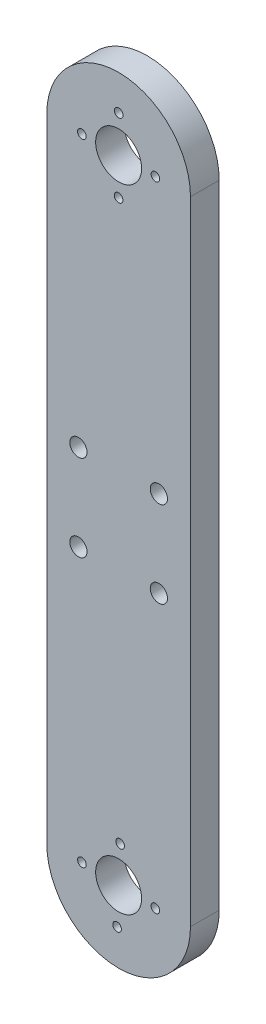
ISO-10303-21;
HEADER;
FILE_DESCRIPTION(('STEP AP214'),'2;1');
FILE_NAME('part.step','',(''),(''),'','','');
FILE_SCHEMA(('AUTOMOTIVE_DESIGN { 1 0 10303 214 1 1 1 1 }'));
ENDSEC;
DATA;
#1=APPLICATION_CONTEXT('core data for automotive mechanical design processes');
#2=APPLICATION_PROTOCOL_DEFINITION('international standard','automotive_design',2000,#1);
#3=PRODUCT_CONTEXT('',#1,'mechanical');
#4=PRODUCT('Part','Part','',(#3));
#5=PRODUCT_RELATED_PRODUCT_CATEGORY('part','',(#4));
#6=PRODUCT_DEFINITION_FORMATION('','',#4);
#7=PRODUCT_DEFINITION_CONTEXT('part definition',#1,'design');
#8=PRODUCT_DEFINITION('design','',#6,#7);
#9=PRODUCT_DEFINITION_SHAPE('','',#8);
#10=(LENGTH_UNIT() NAMED_UNIT(*) SI_UNIT(.MILLI.,.METRE.));
#11=(NAMED_UNIT(*) PLANE_ANGLE_UNIT() SI_UNIT($,.RADIAN.));
#12=(NAMED_UNIT(*) SI_UNIT($,.STERADIAN.) SOLID_ANGLE_UNIT());
#13=UNCERTAINTY_MEASURE_WITH_UNIT(LENGTH_MEASURE(1.E-05),#10,'distance_accuracy_value','');
#14=(GEOMETRIC_REPRESENTATION_CONTEXT(3) GLOBAL_UNCERTAINTY_ASSIGNED_CONTEXT((#13)) GLOBAL_UNIT_ASSIGNED_CONTEXT((#10,
#11,#12)) REPRESENTATION_CONTEXT('',''));
#15=CARTESIAN_POINT('',(0.,0.,0.));
#16=DIRECTION('',(0.,0.,1.));
#17=DIRECTION('',(1.,0.,0.));
#18=AXIS2_PLACEMENT_3D('',#15,#16,#17);
#19=CARTESIAN_POINT('',(0.,0.,5.));
#20=DIRECTION('',(0.,0.,1.));
#21=DIRECTION('',(1.,0.,0.));
#22=AXIS2_PLACEMENT_3D('',#19,#20,#21);
#23=PLANE('',#22);
#24=CARTESIAN_POINT('',(-6.39095011321381,-109.733832455118,5.));
#25=DIRECTION('',(0.,0.,1.));
#26=DIRECTION('',(1.,0.,0.));
#27=AXIS2_PLACEMENT_3D('',#24,#25,#26);
#28=CIRCLE('',#27,0.749999999990413);
#29=CARTESIAN_POINT('',(-5.6409501132234,-109.733832455118,5.));
#30=VERTEX_POINT('',#29);
#31=EDGE_CURVE('E181',#30,#30,#28,.T.);
#32=ORIENTED_EDGE('',*,*,#31,.F.);
#33=EDGE_LOOP('',(#32));
#34=FACE_BOUND('',#33,.T.);
#35=CARTESIAN_POINT('',(6.3964839650597,-0.00902201551031961,5.));
#36=DIRECTION('',(0.,0.,1.));
#37=DIRECTION('',(1.,0.,0.));
#38=AXIS2_PLACEMENT_3D('',#35,#36,#37);
#39=CIRCLE('',#38,0.750000000010934);
#40=CARTESIAN_POINT('',(7.14648396507063,-0.00902201551031961,5.));
#41=VERTEX_POINT('',#40);
#42=EDGE_CURVE('E169',#41,#41,#39,.T.);
#43=ORIENTED_EDGE('',*,*,#42,.F.);
#44=EDGE_LOOP('',(#43));
#45=FACE_BOUND('',#44,.T.);
#46=CARTESIAN_POINT('',(0.00902201505638306,6.39648396453316,5.));
#47=DIRECTION('',(0.,0.,1.));
#48=DIRECTION('',(1.,0.,0.));
#49=AXIS2_PLACEMENT_3D('',#46,#47,#48);
#50=CIRCLE('',#49,0.749999999996068);
#51=CARTESIAN_POINT('',(0.759022015052451,6.39648396453316,5.));
#52=VERTEX_POINT('',#51);
#53=EDGE_CURVE('E157',#52,#52,#50,.T.);
#54=ORIENTED_EDGE('',*,*,#53,.F.);
#55=EDGE_LOOP('',(#54));
#56=FACE_BOUND('',#55,.T.);
#57=CARTESIAN_POINT('',(-6.99999999999999,-62.5,5.));
#58=DIRECTION('',(0.,0.,1.));
#59=DIRECTION('',(-1.,0.,0.));
#60=AXIS2_PLACEMENT_3D('',#57,#58,#59);
#61=CIRCLE('',#60,1.5);
#62=CARTESIAN_POINT('',(-8.49999999999999,-62.5,5.));
#63=VERTEX_POINT('',#62);
#64=EDGE_CURVE('E145',#63,#63,#61,.T.);
#65=ORIENTED_EDGE('',*,*,#64,.F.);
#66=EDGE_LOOP('',(#65));
#67=FACE_BOUND('',#66,.T.);
#68=CARTESIAN_POINT('',(-6.39648396498707,0.00902201452982268,5.));
#69=DIRECTION('',(0.,0.,1.));
#70=DIRECTION('',(1.,0.,0.));
#71=AXIS2_PLACEMENT_3D('',#68,#69,#70);
#72=CIRCLE('',#71,0.749999999989094);
#73=CARTESIAN_POINT('',(-5.64648396499798,0.00902201452982268,5.));
#74=VERTEX_POINT('',#73);
#75=EDGE_CURVE('E133',#74,#74,#72,.T.);
#76=ORIENTED_EDGE('',*,*,#75,.F.);
#77=EDGE_LOOP('',(#76));
#78=FACE_BOUND('',#77,.T.);
#79=CARTESIAN_POINT('',(7.00000000000001,-47.5,5.));
#80=DIRECTION('',(0.,0.,1.));
#81=DIRECTION('',(1.,0.,0.));
#82=AXIS2_PLACEMENT_3D('',#79,#80,#81);
#83=CIRCLE('',#82,1.5);
#84=CARTESIAN_POINT('',(8.50000000000001,-47.5,5.));
#85=VERTEX_POINT('',#84);
#86=EDGE_CURVE('E121',#85,#85,#83,.T.);
#87=ORIENTED_EDGE('',*,*,#86,.F.);
#88=EDGE_LOOP('',(#87));
#89=FACE_BOUND('',#88,.T.);
#90=CARTESIAN_POINT('',(0.,0.,5.));
#91=DIRECTION('',(0.,0.,1.));
#92=DIRECTION('',(1.,0.,0.));
#93=AXIS2_PLACEMENT_3D('',#90,#91,#92);
#94=CIRCLE('',#93,4.);
#95=CARTESIAN_POINT('',(4.,0.,5.));
#96=VERTEX_POINT('',#95);
#97=EDGE_CURVE('E100',#96,#96,#94,.T.);
#98=ORIENTED_EDGE('',*,*,#97,.F.);
#99=EDGE_LOOP('',(#98));
#100=FACE_BOUND('',#99,.T.);
#101=CARTESIAN_POINT('',(0.,0.,5.));
#102=DIRECTION('',(0.,0.,1.));
#103=DIRECTION('',(1.,0.,0.));
#104=AXIS2_PLACEMENT_3D('',#101,#102,#103);
#105=CIRCLE('',#104,12.5);
#106=CARTESIAN_POINT('',(12.5,0.,5.));
#107=VERTEX_POINT('',#106);
#108=CARTESIAN_POINT('',(-12.5,0.,5.));
#109=VERTEX_POINT('',#108);
#110=EDGE_CURVE('E85',#107,#109,#105,.T.);
#111=ORIENTED_EDGE('',*,*,#110,.T.);
#112=DIRECTION('',(0.,-1.,0.));
#113=VECTOR('',#112,1.);
#114=CARTESIAN_POINT('',(-12.5,0.,5.));
#115=LINE('',#114,#113);
#116=CARTESIAN_POINT('',(-12.5,-110.,5.));
#117=VERTEX_POINT('',#116);
#118=EDGE_CURVE('E80',#109,#117,#115,.T.);
#119=ORIENTED_EDGE('',*,*,#118,.T.);
#120=CARTESIAN_POINT('',(0.,-110.,5.));
#121=DIRECTION('',(0.,0.,1.));
#122=DIRECTION('',(1.,0.,0.));
#123=AXIS2_PLACEMENT_3D('',#120,#121,#122);
#124=CIRCLE('',#123,12.5);
#125=CARTESIAN_POINT('',(12.5,-110.,5.));
#126=VERTEX_POINT('',#125);
#127=EDGE_CURVE('E83',#117,#126,#124,.T.);
#128=ORIENTED_EDGE('',*,*,#127,.T.);
#129=DIRECTION('',(0.,1.,0.));
#130=VECTOR('',#129,1.);
#131=CARTESIAN_POINT('',(12.5,0.,5.));
#132=LINE('',#131,#130);
#133=EDGE_CURVE('E50',#126,#107,#132,.T.);
#134=ORIENTED_EDGE('',*,*,#133,.T.);
#135=EDGE_LOOP('',(#111,#119,#128,#134));
#136=FACE_BOUND('',#135,.T.);
#137=CARTESIAN_POINT('',(0.,-110.,5.));
#138=DIRECTION('',(0.,0.,1.));
#139=DIRECTION('',(1.,0.,0.));
#140=AXIS2_PLACEMENT_3D('',#137,#138,#139);
#141=CIRCLE('',#140,4.);
#142=CARTESIAN_POINT('',(4.00000000000001,-110.,5.));
#143=VERTEX_POINT('',#142);
#144=EDGE_CURVE('E115',#143,#143,#141,.T.);
#145=ORIENTED_EDGE('',*,*,#144,.F.);
#146=EDGE_LOOP('',(#145));
#147=FACE_BOUND('',#146,.T.);
#148=CARTESIAN_POINT('',(-6.99999999999999,-47.5,5.));
#149=DIRECTION('',(0.,0.,1.));
#150=DIRECTION('',(1.,0.,0.));
#151=AXIS2_PLACEMENT_3D('',#148,#149,#150);
#152=CIRCLE('',#151,1.5);
#153=CARTESIAN_POINT('',(-5.49999999999999,-47.5,5.));
#154=VERTEX_POINT('',#153);
#155=EDGE_CURVE('E127',#154,#154,#152,.T.);
#156=ORIENTED_EDGE('',*,*,#155,.F.);
#157=EDGE_LOOP('',(#156));
#158=FACE_BOUND('',#157,.T.);
#159=CARTESIAN_POINT('',(7.00000000000001,-62.5,5.));
#160=DIRECTION('',(0.,0.,1.));
#161=DIRECTION('',(-1.,0.,0.));
#162=AXIS2_PLACEMENT_3D('',#159,#160,#161);
#163=CIRCLE('',#162,1.5);
#164=CARTESIAN_POINT('',(5.50000000000001,-62.5,5.));
#165=VERTEX_POINT('',#164);
#166=EDGE_CURVE('E139',#165,#165,#163,.T.);
#167=ORIENTED_EDGE('',*,*,#166,.F.);
#168=EDGE_LOOP('',(#167));
#169=FACE_BOUND('',#168,.T.);
#170=CARTESIAN_POINT('',(6.39095011321716,-110.266167544877,5.));
#171=DIRECTION('',(0.,0.,1.));
#172=DIRECTION('',(1.,0.,0.));
#173=AXIS2_PLACEMENT_3D('',#170,#171,#172);
#174=CIRCLE('',#173,0.750000000009543);
#175=CARTESIAN_POINT('',(7.1409501132267,-110.266167544877,5.));
#176=VERTEX_POINT('',#175);
#177=EDGE_CURVE('E151',#176,#176,#174,.T.);
#178=ORIENTED_EDGE('',*,*,#177,.F.);
#179=EDGE_LOOP('',(#178));
#180=FACE_BOUND('',#179,.T.);
#181=CARTESIAN_POINT('',(-0.00902201498380599,-6.39648396551361,5.));
#182=DIRECTION('',(0.,0.,1.));
#183=DIRECTION('',(1.,0.,0.));
#184=AXIS2_PLACEMENT_3D('',#181,#182,#183);
#185=CIRCLE('',#184,0.750000000003959);
#186=CARTESIAN_POINT('',(0.740977985020153,-6.39648396551361,5.));
#187=VERTEX_POINT('',#186);
#188=EDGE_CURVE('E163',#187,#187,#185,.T.);
#189=ORIENTED_EDGE('',*,*,#188,.F.);
#190=EDGE_LOOP('',(#189));
#191=FACE_BOUND('',#190,.T.);
#192=CARTESIAN_POINT('',(-0.26616754487793,-116.390950113213,5.));
#193=DIRECTION('',(0.,0.,1.));
#194=DIRECTION('',(1.,0.,0.));
#195=AXIS2_PLACEMENT_3D('',#192,#193,#194);
#196=CIRCLE('',#195,0.749999999993405);
#197=CARTESIAN_POINT('',(0.483832455115476,-116.390950113213,5.));
#198=VERTEX_POINT('',#197);
#199=EDGE_CURVE('E175',#198,#198,#196,.T.);
#200=ORIENTED_EDGE('',*,*,#199,.F.);
#201=EDGE_LOOP('',(#200));
#202=FACE_BOUND('',#201,.T.);
#203=CARTESIAN_POINT('',(0.266167544881222,-103.609049886782,5.));
#204=DIRECTION('',(0.,0.,1.));
#205=DIRECTION('',(1.,0.,0.));
#206=AXIS2_PLACEMENT_3D('',#203,#204,#205);
#207=CIRCLE('',#206,0.750000000006553);
#208=CARTESIAN_POINT('',(1.01616754488778,-103.609049886782,5.));
#209=VERTEX_POINT('',#208);
#210=EDGE_CURVE('E187',#209,#209,#207,.T.);
#211=ORIENTED_EDGE('',*,*,#210,.F.);
#212=EDGE_LOOP('',(#211));
#213=FACE_BOUND('',#212,.T.);
#214=ADVANCED_FACE('F33',(#34,#45,#56,#67,#78,#89,#100,#136,#147,#158,#169,#180,#191,#202,#213),
#23,.T.);
#215=CARTESIAN_POINT('',(0.,0.,0.));
#216=DIRECTION('',(0.,0.,1.));
#217=DIRECTION('',(1.,0.,0.));
#218=AXIS2_PLACEMENT_3D('',#215,#216,#217);
#219=PLANE('',#218);
#220=CARTESIAN_POINT('',(0.,0.,0.));
#221=DIRECTION('',(0.,0.,1.));
#222=DIRECTION('',(1.,0.,0.));
#223=AXIS2_PLACEMENT_3D('',#220,#221,#222);
#224=CIRCLE('',#223,12.5);
#225=CARTESIAN_POINT('',(12.5,0.,0.));
#226=VERTEX_POINT('',#225);
#227=CARTESIAN_POINT('',(-12.5,0.,0.));
#228=VERTEX_POINT('',#227);
#229=EDGE_CURVE('E97',#226,#228,#224,.T.);
#230=ORIENTED_EDGE('',*,*,#229,.F.);
#231=DIRECTION('',(0.,1.,0.));
#232=VECTOR('',#231,1.);
#233=CARTESIAN_POINT('',(12.5,0.,0.));
#234=LINE('',#233,#232);
#235=CARTESIAN_POINT('',(12.5,-110.,0.));
#236=VERTEX_POINT('',#235);
#237=EDGE_CURVE('E73',#236,#226,#234,.T.);
#238=ORIENTED_EDGE('',*,*,#237,.F.);
#239=CARTESIAN_POINT('',(0.,-110.,0.));
#240=DIRECTION('',(0.,0.,1.));
#241=DIRECTION('',(1.,0.,0.));
#242=AXIS2_PLACEMENT_3D('',#239,#240,#241);
#243=CIRCLE('',#242,12.5);
#244=CARTESIAN_POINT('',(-12.5,-110.,0.));
#245=VERTEX_POINT('',#244);
#246=EDGE_CURVE('E67',#245,#236,#243,.T.);
#247=ORIENTED_EDGE('',*,*,#246,.F.);
#248=DIRECTION('',(0.,-1.,0.));
#249=VECTOR('',#248,1.);
#250=CARTESIAN_POINT('',(-12.5,0.,0.));
#251=LINE('',#250,#249);
#252=EDGE_CURVE('E89',#228,#245,#251,.T.);
#253=ORIENTED_EDGE('',*,*,#252,.F.);
#254=EDGE_LOOP('',(#230,#238,#247,#253));
#255=FACE_BOUND('',#254,.T.);
#256=CARTESIAN_POINT('',(0.,0.,0.));
#257=DIRECTION('',(0.,0.,1.));
#258=DIRECTION('',(1.,0.,0.));
#259=AXIS2_PLACEMENT_3D('',#256,#257,#258);
#260=CIRCLE('',#259,4.);
#261=CARTESIAN_POINT('',(4.,0.,0.));
#262=VERTEX_POINT('',#261);
#263=EDGE_CURVE('E112',#262,#262,#260,.T.);
#264=ORIENTED_EDGE('',*,*,#263,.T.);
#265=EDGE_LOOP('',(#264));
#266=FACE_BOUND('',#265,.T.);
#267=CARTESIAN_POINT('',(0.,-110.,0.));
#268=DIRECTION('',(0.,0.,1.));
#269=DIRECTION('',(1.,0.,0.));
#270=AXIS2_PLACEMENT_3D('',#267,#268,#269);
#271=CIRCLE('',#270,4.);
#272=CARTESIAN_POINT('',(4.00000000000001,-110.,0.));
#273=VERTEX_POINT('',#272);
#274=EDGE_CURVE('E118',#273,#273,#271,.T.);
#275=ORIENTED_EDGE('',*,*,#274,.T.);
#276=EDGE_LOOP('',(#275));
#277=FACE_BOUND('',#276,.T.);
#278=CARTESIAN_POINT('',(7.00000000000001,-47.5,0.));
#279=DIRECTION('',(0.,0.,1.));
#280=DIRECTION('',(1.,0.,0.));
#281=AXIS2_PLACEMENT_3D('',#278,#279,#280);
#282=CIRCLE('',#281,1.5);
#283=CARTESIAN_POINT('',(8.50000000000001,-47.5,0.));
#284=VERTEX_POINT('',#283);
#285=EDGE_CURVE('E124',#284,#284,#282,.T.);
#286=ORIENTED_EDGE('',*,*,#285,.T.);
#287=EDGE_LOOP('',(#286));
#288=FACE_BOUND('',#287,.T.);
#289=CARTESIAN_POINT('',(-6.99999999999999,-47.5,0.));
#290=DIRECTION('',(0.,0.,1.));
#291=DIRECTION('',(1.,0.,0.));
#292=AXIS2_PLACEMENT_3D('',#289,#290,#291);
#293=CIRCLE('',#292,1.5);
#294=CARTESIAN_POINT('',(-5.49999999999999,-47.5,0.));
#295=VERTEX_POINT('',#294);
#296=EDGE_CURVE('E130',#295,#295,#293,.T.);
#297=ORIENTED_EDGE('',*,*,#296,.T.);
#298=EDGE_LOOP('',(#297));
#299=FACE_BOUND('',#298,.T.);
#300=CARTESIAN_POINT('',(-6.39648396498707,0.00902201452982268,0.));
#301=DIRECTION('',(0.,0.,1.));
#302=DIRECTION('',(1.,0.,0.));
#303=AXIS2_PLACEMENT_3D('',#300,#301,#302);
#304=CIRCLE('',#303,0.749999999989094);
#305=CARTESIAN_POINT('',(-5.64648396499798,0.00902201452982268,0.));
#306=VERTEX_POINT('',#305);
#307=EDGE_CURVE('E136',#306,#306,#304,.T.);
#308=ORIENTED_EDGE('',*,*,#307,.T.);
#309=EDGE_LOOP('',(#308));
#310=FACE_BOUND('',#309,.T.);
#311=CARTESIAN_POINT('',(7.00000000000001,-62.5,0.));
#312=DIRECTION('',(0.,0.,1.));
#313=DIRECTION('',(-1.,0.,0.));
#314=AXIS2_PLACEMENT_3D('',#311,#312,#313);
#315=CIRCLE('',#314,1.5);
#316=CARTESIAN_POINT('',(5.50000000000001,-62.5,0.));
#317=VERTEX_POINT('',#316);
#318=EDGE_CURVE('E142',#317,#317,#315,.T.);
#319=ORIENTED_EDGE('',*,*,#318,.T.);
#320=EDGE_LOOP('',(#319));
#321=FACE_BOUND('',#320,.T.);
#322=CARTESIAN_POINT('',(-6.99999999999999,-62.5,0.));
#323=DIRECTION('',(0.,0.,1.));
#324=DIRECTION('',(-1.,0.,0.));
#325=AXIS2_PLACEMENT_3D('',#322,#323,#324);
#326=CIRCLE('',#325,1.5);
#327=CARTESIAN_POINT('',(-8.49999999999999,-62.5,0.));
#328=VERTEX_POINT('',#327);
#329=EDGE_CURVE('E148',#328,#328,#326,.T.);
#330=ORIENTED_EDGE('',*,*,#329,.T.);
#331=EDGE_LOOP('',(#330));
#332=FACE_BOUND('',#331,.T.);
#333=CARTESIAN_POINT('',(6.39095011321716,-110.266167544877,0.));
#334=DIRECTION('',(0.,0.,1.));
#335=DIRECTION('',(1.,0.,0.));
#336=AXIS2_PLACEMENT_3D('',#333,#334,#335);
#337=CIRCLE('',#336,0.750000000009543);
#338=CARTESIAN_POINT('',(7.1409501132267,-110.266167544877,0.));
#339=VERTEX_POINT('',#338);
#340=EDGE_CURVE('E154',#339,#339,#337,.T.);
#341=ORIENTED_EDGE('',*,*,#340,.T.);
#342=EDGE_LOOP('',(#341));
#343=FACE_BOUND('',#342,.T.);
#344=CARTESIAN_POINT('',(0.00902201505638306,6.39648396453316,0.));
#345=DIRECTION('',(0.,0.,1.));
#346=DIRECTION('',(1.,0.,0.));
#347=AXIS2_PLACEMENT_3D('',#344,#345,#346);
#348=CIRCLE('',#347,0.749999999996068);
#349=CARTESIAN_POINT('',(0.759022015052451,6.39648396453316,0.));
#350=VERTEX_POINT('',#349);
#351=EDGE_CURVE('E160',#350,#350,#348,.T.);
#352=ORIENTED_EDGE('',*,*,#351,.T.);
#353=EDGE_LOOP('',(#352));
#354=FACE_BOUND('',#353,.T.);
#355=CARTESIAN_POINT('',(-0.00902201498380599,-6.39648396551361,0.));
#356=DIRECTION('',(0.,0.,1.));
#357=DIRECTION('',(1.,0.,0.));
#358=AXIS2_PLACEMENT_3D('',#355,#356,#357);
#359=CIRCLE('',#358,0.750000000003959);
#360=CARTESIAN_POINT('',(0.740977985020153,-6.39648396551361,0.));
#361=VERTEX_POINT('',#360);
#362=EDGE_CURVE('E166',#361,#361,#359,.T.);
#363=ORIENTED_EDGE('',*,*,#362,.T.);
#364=EDGE_LOOP('',(#363));
#365=FACE_BOUND('',#364,.T.);
#366=CARTESIAN_POINT('',(6.3964839650597,-0.00902201551031961,0.));
#367=DIRECTION('',(0.,0.,1.));
#368=DIRECTION('',(1.,0.,0.));
#369=AXIS2_PLACEMENT_3D('',#366,#367,#368);
#370=CIRCLE('',#369,0.750000000010934);
#371=CARTESIAN_POINT('',(7.14648396507063,-0.00902201551031961,0.));
#372=VERTEX_POINT('',#371);
#373=EDGE_CURVE('E172',#372,#372,#370,.T.);
#374=ORIENTED_EDGE('',*,*,#373,.T.);
#375=EDGE_LOOP('',(#374));
#376=FACE_BOUND('',#375,.T.);
#377=CARTESIAN_POINT('',(-0.26616754487793,-116.390950113213,0.));
#378=DIRECTION('',(0.,0.,1.));
#379=DIRECTION('',(1.,0.,0.));
#380=AXIS2_PLACEMENT_3D('',#377,#378,#379);
#381=CIRCLE('',#380,0.749999999993405);
#382=CARTESIAN_POINT('',(0.483832455115476,-116.390950113213,0.));
#383=VERTEX_POINT('',#382);
#384=EDGE_CURVE('E178',#383,#383,#381,.T.);
#385=ORIENTED_EDGE('',*,*,#384,.T.);
#386=EDGE_LOOP('',(#385));
#387=FACE_BOUND('',#386,.T.);
#388=CARTESIAN_POINT('',(-6.39095011321381,-109.733832455118,0.));
#389=DIRECTION('',(0.,0.,1.));
#390=DIRECTION('',(1.,0.,0.));
#391=AXIS2_PLACEMENT_3D('',#388,#389,#390);
#392=CIRCLE('',#391,0.749999999990413);
#393=CARTESIAN_POINT('',(-5.6409501132234,-109.733832455118,0.));
#394=VERTEX_POINT('',#393);
#395=EDGE_CURVE('E184',#394,#394,#392,.T.);
#396=ORIENTED_EDGE('',*,*,#395,.T.);
#397=EDGE_LOOP('',(#396));
#398=FACE_BOUND('',#397,.T.);
#399=CARTESIAN_POINT('',(0.266167544881222,-103.609049886782,0.));
#400=DIRECTION('',(0.,0.,1.));
#401=DIRECTION('',(1.,0.,0.));
#402=AXIS2_PLACEMENT_3D('',#399,#400,#401);
#403=CIRCLE('',#402,0.750000000006553);
#404=CARTESIAN_POINT('',(1.01616754488778,-103.609049886782,0.));
#405=VERTEX_POINT('',#404);
#406=EDGE_CURVE('E190',#405,#405,#403,.T.);
#407=ORIENTED_EDGE('',*,*,#406,.T.);
#408=EDGE_LOOP('',(#407));
#409=FACE_BOUND('',#408,.T.);
#410=ADVANCED_FACE('F108',(#255,#266,#277,#288,#299,#310,#321,#332,#343,#354,#365,#376,#387,
#398,#409),#219,.F.);
#411=CARTESIAN_POINT('',(0.,0.,5.));
#412=DIRECTION('',(0.,0.,-1.));
#413=DIRECTION('',(-1.,0.,0.));
#414=AXIS2_PLACEMENT_3D('',#411,#412,#413);
#415=CYLINDRICAL_SURFACE('',#414,12.5);
#416=ORIENTED_EDGE('',*,*,#229,.T.);
#417=DIRECTION('',(0.,0.,-1.));
#418=VECTOR('',#417,1.);
#419=CARTESIAN_POINT('',(-12.5,0.,5.));
#420=LINE('',#419,#418);
#421=EDGE_CURVE('E11',#109,#228,#420,.T.);
#422=ORIENTED_EDGE('',*,*,#421,.F.);
#423=ORIENTED_EDGE('',*,*,#110,.F.);
#424=DIRECTION('',(0.,0.,-1.));
#425=VECTOR('',#424,1.);
#426=CARTESIAN_POINT('',(12.5,0.,5.));
#427=LINE('',#426,#425);
#428=EDGE_CURVE('E93',#107,#226,#427,.T.);
#429=ORIENTED_EDGE('',*,*,#428,.T.);
#430=EDGE_LOOP('',(#416,#422,#423,#429));
#431=FACE_BOUND('',#430,.T.);
#432=ADVANCED_FACE('F35',(#431),#415,.T.);
#433=CARTESIAN_POINT('',(-12.5,0.,5.));
#434=DIRECTION('',(1.,0.,0.));
#435=DIRECTION('',(0.,1.,0.));
#436=AXIS2_PLACEMENT_3D('',#433,#434,#435);
#437=PLANE('',#436);
#438=ORIENTED_EDGE('',*,*,#252,.T.);
#439=DIRECTION('',(0.,0.,-1.));
#440=VECTOR('',#439,1.);
#441=CARTESIAN_POINT('',(-12.5,-110.,5.));
#442=LINE('',#441,#440);
#443=EDGE_CURVE('E42',#117,#245,#442,.T.);
#444=ORIENTED_EDGE('',*,*,#443,.F.);
#445=ORIENTED_EDGE('',*,*,#118,.F.);
#446=ORIENTED_EDGE('',*,*,#421,.T.);
#447=EDGE_LOOP('',(#438,#444,#445,#446));
#448=FACE_BOUND('',#447,.T.);
#449=ADVANCED_FACE('F88',(#448),#437,.F.);
#450=CARTESIAN_POINT('',(0.,-110.,5.));
#451=DIRECTION('',(0.,0.,-1.));
#452=DIRECTION('',(-1.,0.,0.));
#453=AXIS2_PLACEMENT_3D('',#450,#451,#452);
#454=CYLINDRICAL_SURFACE('',#453,12.5);
#455=ORIENTED_EDGE('',*,*,#246,.T.);
#456=DIRECTION('',(0.,0.,-1.));
#457=VECTOR('',#456,1.);
#458=CARTESIAN_POINT('',(12.5,-110.,5.));
#459=LINE('',#458,#457);
#460=EDGE_CURVE('E90',#126,#236,#459,.T.);
#461=ORIENTED_EDGE('',*,*,#460,.F.);
#462=ORIENTED_EDGE('',*,*,#127,.F.);
#463=ORIENTED_EDGE('',*,*,#443,.T.);
#464=EDGE_LOOP('',(#455,#461,#462,#463));
#465=FACE_BOUND('',#464,.T.);
#466=ADVANCED_FACE('F91',(#465),#454,.T.);
#467=CARTESIAN_POINT('',(12.5,0.,5.));
#468=DIRECTION('',(-1.,0.,0.));
#469=DIRECTION('',(0.,-1.,0.));
#470=AXIS2_PLACEMENT_3D('',#467,#468,#469);
#471=PLANE('',#470);
#472=ORIENTED_EDGE('',*,*,#237,.T.);
#473=ORIENTED_EDGE('',*,*,#428,.F.);
#474=ORIENTED_EDGE('',*,*,#133,.F.);
#475=ORIENTED_EDGE('',*,*,#460,.T.);
#476=EDGE_LOOP('',(#472,#473,#474,#475));
#477=FACE_BOUND('',#476,.T.);
#478=ADVANCED_FACE('F105',(#477),#471,.F.);
#479=CARTESIAN_POINT('',(0.,0.,5.));
#480=DIRECTION('',(0.,0.,-1.));
#481=DIRECTION('',(-1.,0.,0.));
#482=AXIS2_PLACEMENT_3D('',#479,#480,#481);
#483=CYLINDRICAL_SURFACE('',#482,4.);
#484=ORIENTED_EDGE('',*,*,#97,.T.);
#485=EDGE_LOOP('',(#484));
#486=FACE_BOUND('',#485,.T.);
#487=ORIENTED_EDGE('',*,*,#263,.F.);
#488=EDGE_LOOP('',(#487));
#489=FACE_BOUND('',#488,.T.);
#490=ADVANCED_FACE('F209',(#486,#489),#483,.F.);
#491=CARTESIAN_POINT('',(0.,-110.,5.));
#492=DIRECTION('',(0.,0.,-1.));
#493=DIRECTION('',(-1.,0.,0.));
#494=AXIS2_PLACEMENT_3D('',#491,#492,#493);
#495=CYLINDRICAL_SURFACE('',#494,4.);
#496=ORIENTED_EDGE('',*,*,#144,.T.);
#497=EDGE_LOOP('',(#496));
#498=FACE_BOUND('',#497,.T.);
#499=ORIENTED_EDGE('',*,*,#274,.F.);
#500=EDGE_LOOP('',(#499));
#501=FACE_BOUND('',#500,.T.);
#502=ADVANCED_FACE('F255',(#498,#501),#495,.F.);
#503=CARTESIAN_POINT('',(7.00000000000001,-47.5,5.));
#504=DIRECTION('',(0.,0.,-1.));
#505=DIRECTION('',(-1.,0.,0.));
#506=AXIS2_PLACEMENT_3D('',#503,#504,#505);
#507=CYLINDRICAL_SURFACE('',#506,1.5);
#508=ORIENTED_EDGE('',*,*,#86,.T.);
#509=EDGE_LOOP('',(#508));
#510=FACE_BOUND('',#509,.T.);
#511=ORIENTED_EDGE('',*,*,#285,.F.);
#512=EDGE_LOOP('',(#511));
#513=FACE_BOUND('',#512,.T.);
#514=ADVANCED_FACE('F263',(#510,#513),#507,.F.);
#515=CARTESIAN_POINT('',(-6.99999999999999,-47.5,5.));
#516=DIRECTION('',(0.,0.,-1.));
#517=DIRECTION('',(-1.,0.,0.));
#518=AXIS2_PLACEMENT_3D('',#515,#516,#517);
#519=CYLINDRICAL_SURFACE('',#518,1.5);
#520=ORIENTED_EDGE('',*,*,#155,.T.);
#521=EDGE_LOOP('',(#520));
#522=FACE_BOUND('',#521,.T.);
#523=ORIENTED_EDGE('',*,*,#296,.F.);
#524=EDGE_LOOP('',(#523));
#525=FACE_BOUND('',#524,.T.);
#526=ADVANCED_FACE('F271',(#522,#525),#519,.F.);
#527=CARTESIAN_POINT('',(-6.39648396498707,0.00902201452982268,5.));
#528=DIRECTION('',(0.,0.,-1.));
#529=DIRECTION('',(-1.,0.,0.));
#530=AXIS2_PLACEMENT_3D('',#527,#528,#529);
#531=CYLINDRICAL_SURFACE('',#530,0.749999999989094);
#532=ORIENTED_EDGE('',*,*,#75,.T.);
#533=EDGE_LOOP('',(#532));
#534=FACE_BOUND('',#533,.T.);
#535=ORIENTED_EDGE('',*,*,#307,.F.);
#536=EDGE_LOOP('',(#535));
#537=FACE_BOUND('',#536,.T.);
#538=ADVANCED_FACE('F280',(#534,#537),#531,.F.);
#539=CARTESIAN_POINT('',(7.00000000000001,-62.5,5.));
#540=DIRECTION('',(0.,0.,-1.));
#541=DIRECTION('',(-1.,0.,0.));
#542=AXIS2_PLACEMENT_3D('',#539,#540,#541);
#543=CYLINDRICAL_SURFACE('',#542,1.5);
#544=ORIENTED_EDGE('',*,*,#166,.T.);
#545=EDGE_LOOP('',(#544));
#546=FACE_BOUND('',#545,.T.);
#547=ORIENTED_EDGE('',*,*,#318,.F.);
#548=EDGE_LOOP('',(#547));
#549=FACE_BOUND('',#548,.T.);
#550=ADVANCED_FACE('F289',(#546,#549),#543,.F.);
#551=CARTESIAN_POINT('',(-6.99999999999999,-62.5,5.));
#552=DIRECTION('',(0.,0.,-1.));
#553=DIRECTION('',(-1.,0.,0.));
#554=AXIS2_PLACEMENT_3D('',#551,#552,#553);
#555=CYLINDRICAL_SURFACE('',#554,1.5);
#556=ORIENTED_EDGE('',*,*,#64,.T.);
#557=EDGE_LOOP('',(#556));
#558=FACE_BOUND('',#557,.T.);
#559=ORIENTED_EDGE('',*,*,#329,.F.);
#560=EDGE_LOOP('',(#559));
#561=FACE_BOUND('',#560,.T.);
#562=ADVANCED_FACE('F298',(#558,#561),#555,.F.);
#563=CARTESIAN_POINT('',(6.39095011321716,-110.266167544877,5.));
#564=DIRECTION('',(0.,0.,-1.));
#565=DIRECTION('',(-1.,0.,0.));
#566=AXIS2_PLACEMENT_3D('',#563,#564,#565);
#567=CYLINDRICAL_SURFACE('',#566,0.750000000009543);
#568=ORIENTED_EDGE('',*,*,#177,.T.);
#569=EDGE_LOOP('',(#568));
#570=FACE_BOUND('',#569,.T.);
#571=ORIENTED_EDGE('',*,*,#340,.F.);
#572=EDGE_LOOP('',(#571));
#573=FACE_BOUND('',#572,.T.);
#574=ADVANCED_FACE('F307',(#570,#573),#567,.F.);
#575=CARTESIAN_POINT('',(0.00902201505638306,6.39648396453316,5.));
#576=DIRECTION('',(0.,0.,-1.));
#577=DIRECTION('',(-1.,0.,0.));
#578=AXIS2_PLACEMENT_3D('',#575,#576,#577);
#579=CYLINDRICAL_SURFACE('',#578,0.749999999996068);
#580=ORIENTED_EDGE('',*,*,#53,.T.);
#581=EDGE_LOOP('',(#580));
#582=FACE_BOUND('',#581,.T.);
#583=ORIENTED_EDGE('',*,*,#351,.F.);
#584=EDGE_LOOP('',(#583));
#585=FACE_BOUND('',#584,.T.);
#586=ADVANCED_FACE('F316',(#582,#585),#579,.F.);
#587=CARTESIAN_POINT('',(-0.00902201498380599,-6.39648396551361,5.));
#588=DIRECTION('',(0.,0.,-1.));
#589=DIRECTION('',(-1.,0.,0.));
#590=AXIS2_PLACEMENT_3D('',#587,#588,#589);
#591=CYLINDRICAL_SURFACE('',#590,0.750000000003959);
#592=ORIENTED_EDGE('',*,*,#188,.T.);
#593=EDGE_LOOP('',(#592));
#594=FACE_BOUND('',#593,.T.);
#595=ORIENTED_EDGE('',*,*,#362,.F.);
#596=EDGE_LOOP('',(#595));
#597=FACE_BOUND('',#596,.T.);
#598=ADVANCED_FACE('F325',(#594,#597),#591,.F.);
#599=CARTESIAN_POINT('',(6.3964839650597,-0.00902201551031961,5.));
#600=DIRECTION('',(0.,0.,-1.));
#601=DIRECTION('',(-1.,0.,0.));
#602=AXIS2_PLACEMENT_3D('',#599,#600,#601);
#603=CYLINDRICAL_SURFACE('',#602,0.750000000010934);
#604=ORIENTED_EDGE('',*,*,#42,.T.);
#605=EDGE_LOOP('',(#604));
#606=FACE_BOUND('',#605,.T.);
#607=ORIENTED_EDGE('',*,*,#373,.F.);
#608=EDGE_LOOP('',(#607));
#609=FACE_BOUND('',#608,.T.);
#610=ADVANCED_FACE('F334',(#606,#609),#603,.F.);
#611=CARTESIAN_POINT('',(-0.26616754487793,-116.390950113213,5.));
#612=DIRECTION('',(0.,0.,-1.));
#613=DIRECTION('',(-1.,0.,0.));
#614=AXIS2_PLACEMENT_3D('',#611,#612,#613);
#615=CYLINDRICAL_SURFACE('',#614,0.749999999993405);
#616=ORIENTED_EDGE('',*,*,#199,.T.);
#617=EDGE_LOOP('',(#616));
#618=FACE_BOUND('',#617,.T.);
#619=ORIENTED_EDGE('',*,*,#384,.F.);
#620=EDGE_LOOP('',(#619));
#621=FACE_BOUND('',#620,.T.);
#622=ADVANCED_FACE('F343',(#618,#621),#615,.F.);
#623=CARTESIAN_POINT('',(-6.39095011321381,-109.733832455118,5.));
#624=DIRECTION('',(0.,0.,-1.));
#625=DIRECTION('',(-1.,0.,0.));
#626=AXIS2_PLACEMENT_3D('',#623,#624,#625);
#627=CYLINDRICAL_SURFACE('',#626,0.749999999990413);
#628=ORIENTED_EDGE('',*,*,#31,.T.);
#629=EDGE_LOOP('',(#628));
#630=FACE_BOUND('',#629,.T.);
#631=ORIENTED_EDGE('',*,*,#395,.F.);
#632=EDGE_LOOP('',(#631));
#633=FACE_BOUND('',#632,.T.);
#634=ADVANCED_FACE('F352',(#630,#633),#627,.F.);
#635=CARTESIAN_POINT('',(0.266167544881222,-103.609049886782,5.));
#636=DIRECTION('',(0.,0.,-1.));
#637=DIRECTION('',(-1.,0.,0.));
#638=AXIS2_PLACEMENT_3D('',#635,#636,#637);
#639=CYLINDRICAL_SURFACE('',#638,0.750000000006553);
#640=ORIENTED_EDGE('',*,*,#210,.T.);
#641=EDGE_LOOP('',(#640));
#642=FACE_BOUND('',#641,.T.);
#643=ORIENTED_EDGE('',*,*,#406,.F.);
#644=EDGE_LOOP('',(#643));
#645=FACE_BOUND('',#644,.T.);
#646=ADVANCED_FACE('F196',(#642,#645),#639,.F.);
#647=CLOSED_SHELL('',(#214,#410,#432,#449,#466,#478,#490,#502,#514,#526,#538,#550,#562,#574,
#586,#598,#610,#622,#634,#646));
#648=MANIFOLD_SOLID_BREP('B2',#647);
#649=ADVANCED_BREP_SHAPE_REPRESENTATION('',(#18,#648),#14);
#650=SHAPE_DEFINITION_REPRESENTATION(#9,#649);
ENDSEC;
END-ISO-10303-21;
